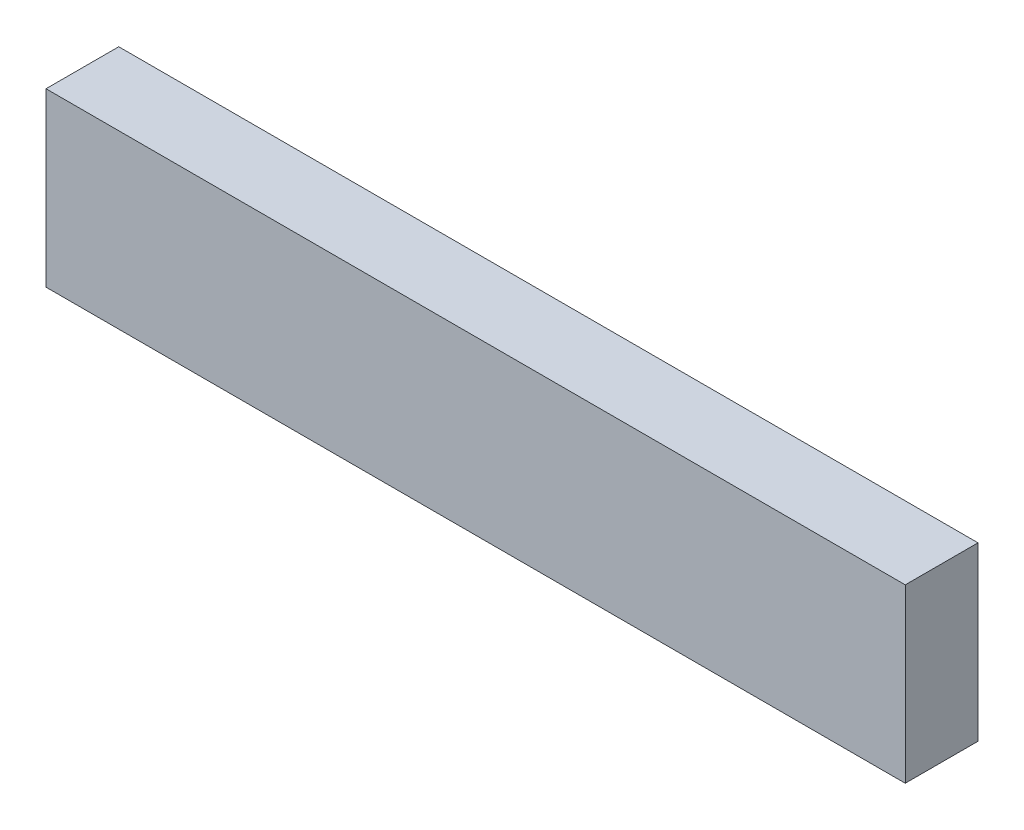
ISO-10303-21;
HEADER;
FILE_DESCRIPTION(('STEP AP214'),'2;1');
FILE_NAME('part.step','',(''),(''),'','','');
FILE_SCHEMA(('AUTOMOTIVE_DESIGN { 1 0 10303 214 1 1 1 1 }'));
ENDSEC;
DATA;
#1=APPLICATION_CONTEXT('core data for automotive mechanical design processes');
#2=APPLICATION_PROTOCOL_DEFINITION('international standard','automotive_design',2000,#1);
#3=PRODUCT_CONTEXT('',#1,'mechanical');
#4=PRODUCT('Part','Part','',(#3));
#5=PRODUCT_RELATED_PRODUCT_CATEGORY('part','',(#4));
#6=PRODUCT_DEFINITION_FORMATION('','',#4);
#7=PRODUCT_DEFINITION_CONTEXT('part definition',#1,'design');
#8=PRODUCT_DEFINITION('design','',#6,#7);
#9=PRODUCT_DEFINITION_SHAPE('','',#8);
#10=(LENGTH_UNIT() NAMED_UNIT(*) SI_UNIT(.MILLI.,.METRE.));
#11=(NAMED_UNIT(*) PLANE_ANGLE_UNIT() SI_UNIT($,.RADIAN.));
#12=(NAMED_UNIT(*) SI_UNIT($,.STERADIAN.) SOLID_ANGLE_UNIT());
#13=UNCERTAINTY_MEASURE_WITH_UNIT(LENGTH_MEASURE(1.E-05),#10,'distance_accuracy_value','');
#14=(GEOMETRIC_REPRESENTATION_CONTEXT(3) GLOBAL_UNCERTAINTY_ASSIGNED_CONTEXT((#13)) GLOBAL_UNIT_ASSIGNED_CONTEXT((#10,
#11,#12)) REPRESENTATION_CONTEXT('',''));
#15=CARTESIAN_POINT('',(0.,0.,0.));
#16=DIRECTION('',(0.,0.,1.));
#17=DIRECTION('',(1.,0.,0.));
#18=AXIS2_PLACEMENT_3D('',#15,#16,#17);
#19=CARTESIAN_POINT('',(0.,0.,6.35));
#20=DIRECTION('',(1.,0.,0.));
#21=DIRECTION('',(0.,0.,-1.));
#22=AXIS2_PLACEMENT_3D('',#19,#20,#21);
#23=PLANE('',#22);
#24=DIRECTION('',(0.,-1.,0.));
#25=VECTOR('',#24,1.);
#26=CARTESIAN_POINT('',(0.,0.,0.));
#27=LINE('',#26,#25);
#28=CARTESIAN_POINT('',(0.,15.,0.));
#29=VERTEX_POINT('',#28);
#30=CARTESIAN_POINT('',(0.,0.,0.));
#31=VERTEX_POINT('',#30);
#32=EDGE_CURVE('E107',#29,#31,#27,.T.);
#33=ORIENTED_EDGE('',*,*,#32,.T.);
#34=DIRECTION('',(0.,0.,-1.));
#35=VECTOR('',#34,1.);
#36=CARTESIAN_POINT('',(0.,0.,6.35));
#37=LINE('',#36,#35);
#38=CARTESIAN_POINT('',(0.,0.,6.35));
#39=VERTEX_POINT('',#38);
#40=EDGE_CURVE('E11',#39,#31,#37,.T.);
#41=ORIENTED_EDGE('',*,*,#40,.F.);
#42=DIRECTION('',(0.,-1.,0.));
#43=VECTOR('',#42,1.);
#44=CARTESIAN_POINT('',(0.,0.,6.35));
#45=LINE('',#44,#43);
#46=CARTESIAN_POINT('',(0.,15.,6.35));
#47=VERTEX_POINT('',#46);
#48=EDGE_CURVE('E91',#47,#39,#45,.T.);
#49=ORIENTED_EDGE('',*,*,#48,.F.);
#50=DIRECTION('',(0.,0.,-1.));
#51=VECTOR('',#50,1.);
#52=CARTESIAN_POINT('',(0.,15.,6.35));
#53=LINE('',#52,#51);
#54=EDGE_CURVE('E103',#47,#29,#53,.T.);
#55=ORIENTED_EDGE('',*,*,#54,.T.);
#56=EDGE_LOOP('',(#33,#41,#49,#55));
#57=FACE_BOUND('',#56,.T.);
#58=ADVANCED_FACE('F39',(#57),#23,.F.);
#59=CARTESIAN_POINT('',(0.,0.,6.35));
#60=DIRECTION('',(0.,1.,0.));
#61=DIRECTION('',(0.,0.,1.));
#62=AXIS2_PLACEMENT_3D('',#59,#60,#61);
#63=PLANE('',#62);
#64=DIRECTION('',(1.,0.,0.));
#65=VECTOR('',#64,1.);
#66=CARTESIAN_POINT('',(0.,0.,0.));
#67=LINE('',#66,#65);
#68=CARTESIAN_POINT('',(75.,0.,0.));
#69=VERTEX_POINT('',#68);
#70=EDGE_CURVE('E96',#31,#69,#67,.T.);
#71=ORIENTED_EDGE('',*,*,#70,.T.);
#72=DIRECTION('',(0.,0.,-1.));
#73=VECTOR('',#72,1.);
#74=CARTESIAN_POINT('',(75.,0.,6.35));
#75=LINE('',#74,#73);
#76=CARTESIAN_POINT('',(75.,0.,6.35));
#77=VERTEX_POINT('',#76);
#78=EDGE_CURVE('E48',#77,#69,#75,.T.);
#79=ORIENTED_EDGE('',*,*,#78,.F.);
#80=DIRECTION('',(1.,0.,0.));
#81=VECTOR('',#80,1.);
#82=CARTESIAN_POINT('',(0.,0.,6.35));
#83=LINE('',#82,#81);
#84=EDGE_CURVE('E86',#39,#77,#83,.T.);
#85=ORIENTED_EDGE('',*,*,#84,.F.);
#86=ORIENTED_EDGE('',*,*,#40,.T.);
#87=EDGE_LOOP('',(#71,#79,#85,#86));
#88=FACE_BOUND('',#87,.T.);
#89=ADVANCED_FACE('F95',(#88),#63,.F.);
#90=CARTESIAN_POINT('',(75.,0.,6.35));
#91=DIRECTION('',(-1.,0.,0.));
#92=DIRECTION('',(0.,0.,1.));
#93=AXIS2_PLACEMENT_3D('',#90,#91,#92);
#94=PLANE('',#93);
#95=DIRECTION('',(0.,1.,0.));
#96=VECTOR('',#95,1.);
#97=CARTESIAN_POINT('',(75.,0.,0.));
#98=LINE('',#97,#96);
#99=CARTESIAN_POINT('',(75.,15.,0.));
#100=VERTEX_POINT('',#99);
#101=EDGE_CURVE('E73',#69,#100,#98,.T.);
#102=ORIENTED_EDGE('',*,*,#101,.T.);
#103=DIRECTION('',(0.,0.,-1.));
#104=VECTOR('',#103,1.);
#105=CARTESIAN_POINT('',(75.,15.,6.35));
#106=LINE('',#105,#104);
#107=CARTESIAN_POINT('',(75.,15.,6.35));
#108=VERTEX_POINT('',#107);
#109=EDGE_CURVE('E98',#108,#100,#106,.T.);
#110=ORIENTED_EDGE('',*,*,#109,.F.);
#111=DIRECTION('',(0.,1.,0.));
#112=VECTOR('',#111,1.);
#113=CARTESIAN_POINT('',(75.,0.,6.35));
#114=LINE('',#113,#112);
#115=EDGE_CURVE('E89',#77,#108,#114,.T.);
#116=ORIENTED_EDGE('',*,*,#115,.F.);
#117=ORIENTED_EDGE('',*,*,#78,.T.);
#118=EDGE_LOOP('',(#102,#110,#116,#117));
#119=FACE_BOUND('',#118,.T.);
#120=ADVANCED_FACE('F99',(#119),#94,.F.);
#121=CARTESIAN_POINT('',(0.,15.,6.35));
#122=DIRECTION('',(0.,-1.,0.));
#123=DIRECTION('',(0.,0.,-1.));
#124=AXIS2_PLACEMENT_3D('',#121,#122,#123);
#125=PLANE('',#124);
#126=DIRECTION('',(-1.,0.,0.));
#127=VECTOR('',#126,1.);
#128=CARTESIAN_POINT('',(0.,15.,0.));
#129=LINE('',#128,#127);
#130=EDGE_CURVE('E79',#100,#29,#129,.T.);
#131=ORIENTED_EDGE('',*,*,#130,.T.);
#132=ORIENTED_EDGE('',*,*,#54,.F.);
#133=DIRECTION('',(-1.,0.,0.));
#134=VECTOR('',#133,1.);
#135=CARTESIAN_POINT('',(0.,15.,6.35));
#136=LINE('',#135,#134);
#137=EDGE_CURVE('E56',#108,#47,#136,.T.);
#138=ORIENTED_EDGE('',*,*,#137,.F.);
#139=ORIENTED_EDGE('',*,*,#109,.T.);
#140=EDGE_LOOP('',(#131,#132,#138,#139));
#141=FACE_BOUND('',#140,.T.);
#142=ADVANCED_FACE('F120',(#141),#125,.F.);
#143=CARTESIAN_POINT('',(0.,0.,6.35));
#144=DIRECTION('',(0.,0.,-1.));
#145=DIRECTION('',(-1.,0.,0.));
#146=AXIS2_PLACEMENT_3D('',#143,#144,#145);
#147=PLANE('',#146);
#148=ORIENTED_EDGE('',*,*,#48,.T.);
#149=ORIENTED_EDGE('',*,*,#84,.T.);
#150=ORIENTED_EDGE('',*,*,#115,.T.);
#151=ORIENTED_EDGE('',*,*,#137,.T.);
#152=EDGE_LOOP('',(#148,#149,#150,#151));
#153=FACE_BOUND('',#152,.T.);
#154=ADVANCED_FACE('F87',(#153),#147,.F.);
#155=CARTESIAN_POINT('',(0.,0.,0.));
#156=DIRECTION('',(0.,0.,-1.));
#157=DIRECTION('',(-1.,0.,0.));
#158=AXIS2_PLACEMENT_3D('',#155,#156,#157);
#159=PLANE('',#158);
#160=ORIENTED_EDGE('',*,*,#32,.F.);
#161=ORIENTED_EDGE('',*,*,#130,.F.);
#162=ORIENTED_EDGE('',*,*,#101,.F.);
#163=ORIENTED_EDGE('',*,*,#70,.F.);
#164=EDGE_LOOP('',(#160,#161,#162,#163));
#165=FACE_BOUND('',#164,.T.);
#166=ADVANCED_FACE('F123',(#165),#159,.T.);
#167=CLOSED_SHELL('',(#58,#89,#120,#142,#154,#166));
#168=MANIFOLD_SOLID_BREP('B2',#167);
#169=ADVANCED_BREP_SHAPE_REPRESENTATION('',(#18,#168),#14);
#170=SHAPE_DEFINITION_REPRESENTATION(#9,#169);
ENDSEC;
END-ISO-10303-21;
